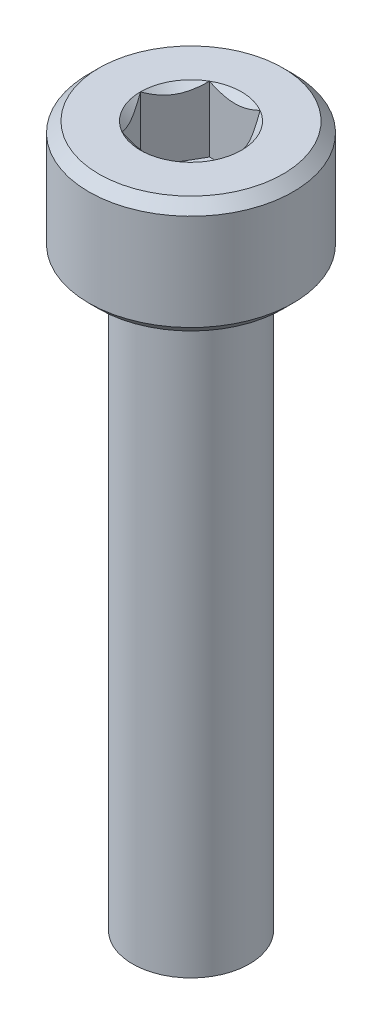
ISO-10303-21;
HEADER;
FILE_DESCRIPTION(('STEP AP214'),'2;1');
FILE_NAME('part.step','',(''),(''),'','','');
FILE_SCHEMA(('AUTOMOTIVE_DESIGN { 1 0 10303 214 1 1 1 1 }'));
ENDSEC;
DATA;
#1=APPLICATION_CONTEXT('core data for automotive mechanical design processes');
#2=APPLICATION_PROTOCOL_DEFINITION('international standard','automotive_design',2000,#1);
#3=PRODUCT_CONTEXT('',#1,'mechanical');
#4=PRODUCT('Part','Part','',(#3));
#5=PRODUCT_RELATED_PRODUCT_CATEGORY('part','',(#4));
#6=PRODUCT_DEFINITION_FORMATION('','',#4);
#7=PRODUCT_DEFINITION_CONTEXT('part definition',#1,'design');
#8=PRODUCT_DEFINITION('design','',#6,#7);
#9=PRODUCT_DEFINITION_SHAPE('','',#8);
#10=(LENGTH_UNIT() NAMED_UNIT(*) SI_UNIT(.MILLI.,.METRE.));
#11=(NAMED_UNIT(*) PLANE_ANGLE_UNIT() SI_UNIT($,.RADIAN.));
#12=(NAMED_UNIT(*) SI_UNIT($,.STERADIAN.) SOLID_ANGLE_UNIT());
#13=UNCERTAINTY_MEASURE_WITH_UNIT(LENGTH_MEASURE(1.E-05),#10,'distance_accuracy_value','');
#14=(GEOMETRIC_REPRESENTATION_CONTEXT(3) GLOBAL_UNCERTAINTY_ASSIGNED_CONTEXT((#13)) GLOBAL_UNIT_ASSIGNED_CONTEXT((#10,
#11,#12)) REPRESENTATION_CONTEXT('',''));
#15=CARTESIAN_POINT('',(0.,0.,0.));
#16=DIRECTION('',(0.,0.,1.));
#17=DIRECTION('',(1.,0.,0.));
#18=AXIS2_PLACEMENT_3D('',#15,#16,#17);
#19=CARTESIAN_POINT('',(0.,4.,0.));
#20=DIRECTION('',(0.,-1.,0.));
#21=DIRECTION('',(0.,0.,-1.));
#22=AXIS2_PLACEMENT_3D('',#19,#20,#21);
#23=CYLINDRICAL_SURFACE('',#22,3.5);
#24=CARTESIAN_POINT('',(0.,0.350000000000001,0.));
#25=DIRECTION('',(0.,1.,0.));
#26=DIRECTION('',(0.,0.,1.));
#27=AXIS2_PLACEMENT_3D('',#24,#25,#26);
#28=CIRCLE('',#27,3.5);
#29=CARTESIAN_POINT('',(0.,0.350000000000001,3.5));
#30=VERTEX_POINT('',#29);
#31=EDGE_CURVE('E227',#30,#30,#28,.T.);
#32=ORIENTED_EDGE('',*,*,#31,.T.);
#33=EDGE_LOOP('',(#32));
#34=FACE_BOUND('',#33,.T.);
#35=CARTESIAN_POINT('',(0.,3.65,0.));
#36=DIRECTION('',(0.,1.,0.));
#37=DIRECTION('',(0.,0.,1.));
#38=AXIS2_PLACEMENT_3D('',#35,#36,#37);
#39=CIRCLE('',#38,3.5);
#40=CARTESIAN_POINT('',(0.,3.65,3.5));
#41=VERTEX_POINT('',#40);
#42=EDGE_CURVE('E104',#41,#41,#39,.F.);
#43=ORIENTED_EDGE('',*,*,#42,.T.);
#44=EDGE_LOOP('',(#43));
#45=FACE_BOUND('',#44,.T.);
#46=ADVANCED_FACE('F32',(#34,#45),#23,.T.);
#47=CARTESIAN_POINT('',(0.,4.,0.));
#48=DIRECTION('',(0.,1.,0.));
#49=DIRECTION('',(0.,0.,1.));
#50=AXIS2_PLACEMENT_3D('',#47,#48,#49);
#51=PLANE('',#50);
#52=CARTESIAN_POINT('',(0.,4.,0.));
#53=DIRECTION('',(0.,1.,0.));
#54=DIRECTION('',(0.,0.,1.));
#55=AXIS2_PLACEMENT_3D('',#52,#53,#54);
#56=CIRCLE('',#55,3.15);
#57=CARTESIAN_POINT('',(0.,4.,3.15));
#58=VERTEX_POINT('',#57);
#59=EDGE_CURVE('E36',#58,#58,#56,.T.);
#60=ORIENTED_EDGE('',*,*,#59,.T.);
#61=EDGE_LOOP('',(#60));
#62=FACE_BOUND('',#61,.T.);
#63=CARTESIAN_POINT('',(0.,4.,0.));
#64=DIRECTION('',(0.,1.,0.));
#65=DIRECTION('',(0.,0.,1.));
#66=AXIS2_PLACEMENT_3D('',#63,#64,#65);
#67=CIRCLE('',#66,1.73205080756888);
#68=CARTESIAN_POINT('',(0.866025403784438,4.,1.5));
#69=VERTEX_POINT('',#68);
#70=CARTESIAN_POINT('',(1.73205080756888,4.,0.));
#71=VERTEX_POINT('',#70);
#72=EDGE_CURVE('E47',#69,#71,#67,.T.);
#73=ORIENTED_EDGE('',*,*,#72,.F.);
#74=CARTESIAN_POINT('',(-0.866025403784438,4.,1.5));
#75=VERTEX_POINT('',#74);
#76=EDGE_CURVE('E54',#75,#69,#67,.T.);
#77=ORIENTED_EDGE('',*,*,#76,.F.);
#78=CARTESIAN_POINT('',(-1.73205080756888,4.,0.));
#79=VERTEX_POINT('',#78);
#80=EDGE_CURVE('E127',#79,#75,#67,.T.);
#81=ORIENTED_EDGE('',*,*,#80,.F.);
#82=CARTESIAN_POINT('',(-0.866025403784439,4.,-1.5));
#83=VERTEX_POINT('',#82);
#84=EDGE_CURVE('E126',#83,#79,#67,.T.);
#85=ORIENTED_EDGE('',*,*,#84,.F.);
#86=CARTESIAN_POINT('',(0.866025403784438,4.,-1.5));
#87=VERTEX_POINT('',#86);
#88=EDGE_CURVE('E94',#87,#83,#67,.T.);
#89=ORIENTED_EDGE('',*,*,#88,.F.);
#90=EDGE_CURVE('E86',#71,#87,#67,.T.);
#91=ORIENTED_EDGE('',*,*,#90,.F.);
#92=EDGE_LOOP('',(#73,#77,#81,#85,#89,#91));
#93=FACE_BOUND('',#92,.T.);
#94=ADVANCED_FACE('F124',(#62,#93),#51,.T.);
#95=CARTESIAN_POINT('',(0.,0.,0.));
#96=DIRECTION('',(0.,1.,0.));
#97=DIRECTION('',(0.,0.,1.));
#98=AXIS2_PLACEMENT_3D('',#95,#96,#97);
#99=PLANE('',#98);
#100=CARTESIAN_POINT('',(0.,0.,0.));
#101=DIRECTION('',(0.,-1.,0.));
#102=DIRECTION('',(0.,0.,-1.));
#103=AXIS2_PLACEMENT_3D('',#100,#101,#102);
#104=CIRCLE('',#103,2.);
#105=CARTESIAN_POINT('',(0.,0.,-2.));
#106=VERTEX_POINT('',#105);
#107=EDGE_CURVE('E11',#106,#106,#104,.T.);
#108=ORIENTED_EDGE('',*,*,#107,.F.);
#109=EDGE_LOOP('',(#108));
#110=FACE_BOUND('',#109,.T.);
#111=CARTESIAN_POINT('',(0.,0.,0.));
#112=DIRECTION('',(0.,1.,0.));
#113=DIRECTION('',(0.,0.,1.));
#114=AXIS2_PLACEMENT_3D('',#111,#112,#113);
#115=CIRCLE('',#114,3.15);
#116=CARTESIAN_POINT('',(0.,0.,3.15));
#117=VERTEX_POINT('',#116);
#118=EDGE_CURVE('E225',#117,#117,#115,.F.);
#119=ORIENTED_EDGE('',*,*,#118,.T.);
#120=EDGE_LOOP('',(#119));
#121=FACE_BOUND('',#120,.T.);
#122=ADVANCED_FACE('F208',(#110,#121),#99,.F.);
#123=CARTESIAN_POINT('',(0.,4.,0.));
#124=DIRECTION('',(0.,1.,0.));
#125=DIRECTION('',(0.,0.,1.));
#126=AXIS2_PLACEMENT_3D('',#123,#124,#125);
#127=CONICAL_SURFACE('',#126,1.73205080756888,0.78539816339745);
#128=ORIENTED_EDGE('',*,*,#88,.T.);
#129=CARTESIAN_POINT('',(-1.72720812969692,4.55557851627079,-1.5));
#130=CARTESIAN_POINT('',(-1.68515175699268,4.52382990785743,-1.5));
#131=CARTESIAN_POINT('',(-1.64286104748673,4.49239259380738,-1.5));
#132=CARTESIAN_POINT('',(-1.55771581035942,4.43026908755641,-1.5));
#133=CARTESIAN_POINT('',(-1.51486114386668,4.3995830858922,-1.5));
#134=CARTESIAN_POINT('',(-1.3846813415127,4.30840719242716,-1.5));
#135=CARTESIAN_POINT('',(-1.29637976071654,4.24928834342677,-1.5));
#136=CARTESIAN_POINT('',(-1.11121478730467,4.1332309963165,-1.5));
#137=CARTESIAN_POINT('',(-1.01415038238167,4.07660955873301,-1.5));
#138=CARTESIAN_POINT('',(-0.815173408897606,3.97303688126565,-1.5));
#139=CARTESIAN_POINT('',(-0.713278669253285,3.92605304154167,-1.5));
#140=CARTESIAN_POINT('',(-0.560333774943112,3.86857266843083,-1.5));
#141=CARTESIAN_POINT('',(-0.511547982948042,3.85207538775725,-1.5));
#142=CARTESIAN_POINT('',(-0.412798620136866,3.822997512927,-1.5));
#143=CARTESIAN_POINT('',(-0.362834968437563,3.81041718859402,-1.5));
#144=CARTESIAN_POINT('',(-0.262863235444982,3.79003619414677,-1.5));
#145=CARTESIAN_POINT('',(-0.212872113808023,3.78215363274598,-1.5));
#146=CARTESIAN_POINT('',(-0.112355243569545,3.771322063969,-1.5));
#147=CARTESIAN_POINT('',(-0.0618295883726279,3.76837220852435,-1.5));
#148=CARTESIAN_POINT('',(0.037429173332384,3.76762485772485,-1.5));
#149=CARTESIAN_POINT('',(0.0861609672002989,3.76964473355808,-1.5));
#150=CARTESIAN_POINT('',(0.183206937768827,3.77832255289676,-1.5));
#151=CARTESIAN_POINT('',(0.231521073438269,3.78498094696846,-1.5));
#152=CARTESIAN_POINT('',(0.328199853425436,3.80268524412257,-1.5));
#153=CARTESIAN_POINT('',(0.376550616310328,3.81380581125704,-1.5));
#154=CARTESIAN_POINT('',(0.472195697125598,3.83984341404871,-1.5));
#155=CARTESIAN_POINT('',(0.51949010309274,3.85476013204094,-1.5));
#156=CARTESIAN_POINT('',(0.668391282696624,3.90733522359607,-1.5));
#157=CARTESIAN_POINT('',(0.767878709508552,3.95098128747198,-1.5));
#158=CARTESIAN_POINT('',(0.962179866690724,4.0480229945931,-1.5));
#159=CARTESIAN_POINT('',(1.05697519961444,4.10145366508953,-1.5));
#160=CARTESIAN_POINT('',(1.23814273533383,4.21168585200456,-1.5));
#161=CARTESIAN_POINT('',(1.3246994218129,4.2681879206986,-1.5));
#162=CARTESIAN_POINT('',(1.45222331290673,4.35553430157866,-1.5));
#163=CARTESIAN_POINT('',(1.49418091978756,4.38495775868004,-1.5));
#164=CARTESIAN_POINT('',(1.57752272931476,4.44458282183046,-1.5));
#165=CARTESIAN_POINT('',(1.61890708647354,4.47478421166444,-1.5));
#166=CARTESIAN_POINT('',(1.66005278019494,4.50530817860946,-1.5));
#167=B_SPLINE_CURVE_WITH_KNOTS('',3,(#129,#130,#131,#132,#133,#134,#135,#136,#137,#138,#139,
#140,#141,#142,#143,#144,#145,#146,#147,#148,#149,#150,#151,#152,#153,#154,#155,#156,#157,#158,
#159,#160,#161,#162,#163,#164,#165,#166),.UNSPECIFIED.,.F.,.F.,(4,2,2,2,2,2,2,2,2,2,2,2,2,2,2,2,
2,2,4),(0.,0.158079548982669,0.316198780993942,0.634850417346958,0.971690311361509,
1.30737131660667,1.46173961127089,1.61611853740677,1.76772101421409,1.91929742368538,
2.065387412096,2.21149159305544,2.36014984633872,2.50879566386709,2.83376031422673,
3.15991186985652,3.46985601802197,3.62358896039974,3.7772796264207),.UNSPECIFIED.);
#168=EDGE_CURVE('E99',#87,#83,#167,.F.);
#169=ORIENTED_EDGE('',*,*,#168,.F.);
#170=EDGE_LOOP('',(#128,#169));
#171=FACE_BOUND('',#170,.T.);
#172=ADVANCED_FACE('F100',(#171),#127,.F.);
#173=ORIENTED_EDGE('',*,*,#84,.T.);
#174=CARTESIAN_POINT('',(-0.865909933730601,4.00011548160007,-1.5002));
#175=CARTESIAN_POINT('',(-0.895682611594166,3.97036547606733,-1.44863220926292));
#176=CARTESIAN_POINT('',(-0.925953159489765,3.94236248391031,-1.3962020823348));
#177=CARTESIAN_POINT('',(-0.987678321317123,3.89108923044014,-1.2892909659444));
#178=CARTESIAN_POINT('',(-1.01913880822717,3.86784750504437,-1.23479980418534));
#179=CARTESIAN_POINT('',(-1.08257741237344,3.82803372899222,-1.12492091864275));
#180=CARTESIAN_POINT('',(-1.11453936608521,3.8113615856709,-1.0695611909048));
#181=CARTESIAN_POINT('',(-1.1791670593912,3.7856744568181,-0.957622742522849));
#182=CARTESIAN_POINT('',(-1.21183082354213,3.77664029047887,-0.901047443446992));
#183=CARTESIAN_POINT('',(-1.26812411040032,3.76848908122685,-0.803544610483559));
#184=CARTESIAN_POINT('',(-1.29168087824208,3.76728225298922,-0.762743091719534));
#185=CARTESIAN_POINT('',(-1.33875285845138,3.76931405716227,-0.681212030384142));
#186=CARTESIAN_POINT('',(-1.36226806050018,3.77255367074831,-0.64048250568537));
#187=CARTESIAN_POINT('',(-1.40907206156905,3.78329198598196,-0.559415597836584));
#188=CARTESIAN_POINT('',(-1.43236062923612,3.79079465301873,-0.519078615401712));
#189=CARTESIAN_POINT('',(-1.47854689118996,3.80965161192829,-0.439081663085969));
#190=CARTESIAN_POINT('',(-1.50144441326545,3.82100755701858,-0.399421991483792));
#191=CARTESIAN_POINT('',(-1.56009461325633,3.85472164759267,-0.297836865225515));
#192=CARTESIAN_POINT('',(-1.59548353987866,3.87962184909337,-0.236541446290311));
#193=CARTESIAN_POINT('',(-1.64751843074894,3.92165665327158,-0.146414371536686));
#194=CARTESIAN_POINT('',(-1.66466545167617,3.9364251535591,-0.116714860092282));
#195=CARTESIAN_POINT('',(-1.69864410935691,3.96731056594017,-0.0578620986162487));
#196=CARTESIAN_POINT('',(-1.71547589206761,3.98342683412171,-0.0287085957793624));
#197=CARTESIAN_POINT('',(-1.73216627762272,4.00011548160007,0.00020000000000028));
#198=B_SPLINE_CURVE_WITH_KNOTS('',3,(#174,#175,#176,#177,#178,#179,#180,#181,#182,#183,#184,
#185,#186,#187,#188,#189,#190,#191,#192,#193,#194,#195,#196,#197),.UNSPECIFIED.,.F.,.F.,(4,2,2,
2,2,2,2,2,2,2,2,4),(0.,0.199829143693304,0.400822987382388,0.598623720538181,0.795926240188889,
0.937113067959881,1.07833105577193,1.21968061668222,1.36109089931054,1.58570969637565,
1.69770705470964,1.80965120737194),.UNSPECIFIED.);
#199=EDGE_CURVE('E129',#83,#79,#198,.T.);
#200=ORIENTED_EDGE('',*,*,#199,.F.);
#201=EDGE_LOOP('',(#173,#200));
#202=FACE_BOUND('',#201,.T.);
#203=ADVANCED_FACE('F240',(#202),#127,.F.);
#204=ORIENTED_EDGE('',*,*,#80,.T.);
#205=CARTESIAN_POINT('',(-1.73216627762272,4.00011548160007,-0.000199999999999694));
#206=CARTESIAN_POINT('',(-1.70239359975915,3.97036547606733,0.051367790737076));
#207=CARTESIAN_POINT('',(-1.67212305186355,3.94236248391031,0.103797917665201));
#208=CARTESIAN_POINT('',(-1.61039789003619,3.89108923044014,0.210709034055597));
#209=CARTESIAN_POINT('',(-1.57893740312614,3.86784750504437,0.265200195814662));
#210=CARTESIAN_POINT('',(-1.51549879897987,3.82803372899222,0.375079081357249));
#211=CARTESIAN_POINT('',(-1.4835368452681,3.8113615856709,0.4304388090952));
#212=CARTESIAN_POINT('',(-1.41890915196211,3.7856744568181,0.542377257477151));
#213=CARTESIAN_POINT('',(-1.38624538781118,3.77664029047887,0.598952556553009));
#214=CARTESIAN_POINT('',(-1.32995210095299,3.76848908122685,0.696455389516441));
#215=CARTESIAN_POINT('',(-1.30639533311124,3.76728225298922,0.737256908280466));
#216=CARTESIAN_POINT('',(-1.25932335290193,3.76931405716227,0.818787969615858));
#217=CARTESIAN_POINT('',(-1.23580815085313,3.77255367074831,0.85951749431463));
#218=CARTESIAN_POINT('',(-1.18900414978427,3.78329198598196,0.940584402163416));
#219=CARTESIAN_POINT('',(-1.1657155821172,3.79079465301873,0.980921384598288));
#220=CARTESIAN_POINT('',(-1.11952932016335,3.80965161192829,1.06091833691403));
#221=CARTESIAN_POINT('',(-1.09663179808786,3.82100755701859,1.10057800851621));
#222=CARTESIAN_POINT('',(-1.03798159809698,3.85472164759267,1.20216313477448));
#223=CARTESIAN_POINT('',(-1.00259267147465,3.87962184909337,1.26345855370969));
#224=CARTESIAN_POINT('',(-0.950557780604375,3.92165665327158,1.35358562846331));
#225=CARTESIAN_POINT('',(-0.933410759677147,3.9364251535591,1.38328513990772));
#226=CARTESIAN_POINT('',(-0.899432101996407,3.96731056594017,1.44213790138375));
#227=CARTESIAN_POINT('',(-0.88260031928571,3.98342683412171,1.47129140422064));
#228=CARTESIAN_POINT('',(-0.865909933730601,4.00011548160007,1.5002));
#229=B_SPLINE_CURVE_WITH_KNOTS('',3,(#205,#206,#207,#208,#209,#210,#211,#212,#213,#214,#215,
#216,#217,#218,#219,#220,#221,#222,#223,#224,#225,#226,#227,#228),.UNSPECIFIED.,.F.,.F.,(4,2,2,
2,2,2,2,2,2,2,2,4),(0.,0.199829143693305,0.400822987382389,0.598623720538181,0.795926240188889,
0.937113067959881,1.07833105577193,1.21968061668222,1.36109089931054,1.58570969637565,
1.69770705470964,1.80965120737194),.UNSPECIFIED.);
#230=EDGE_CURVE('E139',#79,#75,#229,.T.);
#231=ORIENTED_EDGE('',*,*,#230,.F.);
#232=EDGE_LOOP('',(#204,#231));
#233=FACE_BOUND('',#232,.T.);
#234=ADVANCED_FACE('F256',(#233),#127,.F.);
#235=ORIENTED_EDGE('',*,*,#76,.T.);
#236=CARTESIAN_POINT('',(-1.72720812994822,4.55557851646053,1.5));
#237=CARTESIAN_POINT('',(-1.68515175723693,4.52382990803985,1.5));
#238=CARTESIAN_POINT('',(-1.64286104772391,4.49239259398251,1.5));
#239=CARTESIAN_POINT('',(-1.55771581058238,4.43026908771699,1.5));
#240=CARTESIAN_POINT('',(-1.51486114408249,4.39958308604553,1.5));
#241=CARTESIAN_POINT('',(-1.38468134170665,4.30840719255859,1.5));
#242=CARTESIAN_POINT('',(-1.29637976089561,4.24928834354366,1.5));
#243=CARTESIAN_POINT('',(-1.11121478745132,4.13323099640349,1.5));
#244=CARTESIAN_POINT('',(-1.01415038251067,4.07660955880473,1.5));
#245=CARTESIAN_POINT('',(-0.815173408989814,3.9730368813091,1.5));
#246=CARTESIAN_POINT('',(-0.71327866932636,3.92605304157206,1.5));
#247=CARTESIAN_POINT('',(-0.56033377500179,3.86857266845154,1.5));
#248=CARTESIAN_POINT('',(-0.511547983012749,3.85207538777834,1.5));
#249=CARTESIAN_POINT('',(-0.412798620213828,3.82299751294763,1.5));
#250=CARTESIAN_POINT('',(-0.362834968520751,3.8104171886138,1.5));
#251=CARTESIAN_POINT('',(-0.262863235540417,3.79003619416346,1.5));
#252=CARTESIAN_POINT('',(-0.212872113909475,3.78215363276045,1.5));
#253=CARTESIAN_POINT('',(-0.112355243682832,3.77132206397768,1.5));
#254=CARTESIAN_POINT('',(-0.061829588491731,3.76837220852945,1.5));
#255=CARTESIAN_POINT('',(0.0374291732025493,3.76762485772178,1.5));
#256=CARTESIAN_POINT('',(0.086160967065534,3.76964473355048,1.5));
#257=CARTESIAN_POINT('',(0.183206937624695,3.77832255287941,1.5));
#258=CARTESIAN_POINT('',(0.2315210732897,3.78498094694588,1.5));
#259=CARTESIAN_POINT('',(0.328199853268108,3.80268524408904,1.5));
#260=CARTESIAN_POINT('',(0.376550616148692,3.81380581121775,1.5));
#261=CARTESIAN_POINT('',(0.47219569695576,3.83984341399777,1.5));
#262=CARTESIAN_POINT('',(0.51949010291901,3.8547601319841,1.5));
#263=CARTESIAN_POINT('',(0.668391282485064,3.90733522351148,1.5));
#264=CARTESIAN_POINT('',(0.767878709264951,3.95098128736184,1.5));
#265=CARTESIAN_POINT('',(0.9621798663855,4.04802299442906,1.5));
#266=CARTESIAN_POINT('',(1.05697519927965,4.10145366489712,1.5));
#267=CARTESIAN_POINT('',(1.23814273494588,4.21168585175783,1.5));
#268=CARTESIAN_POINT('',(1.32469942140117,4.26818792042618,1.5));
#269=CARTESIAN_POINT('',(1.45222331245985,4.35553430126784,1.5));
#270=CARTESIAN_POINT('',(1.49418091932912,4.38495775835653,1.5));
#271=CARTESIAN_POINT('',(1.5775227288333,4.44458282148157,1.5));
#272=CARTESIAN_POINT('',(1.6189070859806,4.47478421130286,1.5));
#273=CARTESIAN_POINT('',(1.66005277969054,4.50530817823521,1.5));
#274=B_SPLINE_CURVE_WITH_KNOTS('',3,(#236,#237,#238,#239,#240,#241,#242,#243,#244,#245,#246,
#247,#248,#249,#250,#251,#252,#253,#254,#255,#256,#257,#258,#259,#260,#261,#262,#263,#264,#265,
#266,#267,#268,#269,#270,#271,#272,#273),.UNSPECIFIED.,.F.,.F.,(4,2,2,2,2,2,2,2,2,2,2,2,2,2,2,2,
2,2,4),(0.,0.158079549012757,0.316198781054129,0.634850417468465,0.971690311551782,
1.30737131686505,1.46173961151184,1.61611853763032,1.76772101442095,1.91929742387554,
2.06538741227089,2.21149159321503,2.36014984648185,2.50879566399376,2.83376031423511,
3.15991186974582,3.4698560178094,3.62358896013692,3.77727962610764),.UNSPECIFIED.);
#275=EDGE_CURVE('E168',#75,#69,#274,.T.);
#276=ORIENTED_EDGE('',*,*,#275,.F.);
#277=EDGE_LOOP('',(#235,#276));
#278=FACE_BOUND('',#277,.T.);
#279=ADVANCED_FACE('F286',(#278),#127,.F.);
#280=ORIENTED_EDGE('',*,*,#72,.T.);
#281=CARTESIAN_POINT('',(0.865909933730601,4.00011548160007,1.5002));
#282=CARTESIAN_POINT('',(0.895682611594166,3.97036547606733,1.44863220926292));
#283=CARTESIAN_POINT('',(0.925953159489765,3.94236248391031,1.3962020823348));
#284=CARTESIAN_POINT('',(0.987678321317124,3.89108923044014,1.2892909659444));
#285=CARTESIAN_POINT('',(1.01913880822717,3.86784750504437,1.23479980418534));
#286=CARTESIAN_POINT('',(1.08257741237344,3.82803372899222,1.12492091864275));
#287=CARTESIAN_POINT('',(1.11453936608521,3.8113615856709,1.0695611909048));
#288=CARTESIAN_POINT('',(1.1791670593912,3.7856744568181,0.95762274252285));
#289=CARTESIAN_POINT('',(1.21183082354213,3.77664029047887,0.901047443446992));
#290=CARTESIAN_POINT('',(1.26812411040032,3.76848908122685,0.80354461048356));
#291=CARTESIAN_POINT('',(1.29168087824208,3.76728225298922,0.762743091719534));
#292=CARTESIAN_POINT('',(1.33875285845138,3.76931405716227,0.681212030384142));
#293=CARTESIAN_POINT('',(1.36226806050018,3.77255367074831,0.640482505685371));
#294=CARTESIAN_POINT('',(1.40907206156905,3.78329198598196,0.559415597836584));
#295=CARTESIAN_POINT('',(1.43236062923612,3.79079465301873,0.519078615401712));
#296=CARTESIAN_POINT('',(1.47854689118996,3.80965161192829,0.43908166308597));
#297=CARTESIAN_POINT('',(1.50144441326545,3.82100755701859,0.399421991483792));
#298=CARTESIAN_POINT('',(1.56009461325633,3.85472164759267,0.297836865225515));
#299=CARTESIAN_POINT('',(1.59548353987866,3.87962184909337,0.236541446290311));
#300=CARTESIAN_POINT('',(1.64751843074894,3.92165665327158,0.146414371536686));
#301=CARTESIAN_POINT('',(1.66466545167617,3.9364251535591,0.116714860092282));
#302=CARTESIAN_POINT('',(1.69864410935691,3.96731056594017,0.0578620986162488));
#303=CARTESIAN_POINT('',(1.71547589206761,3.98342683412171,0.0287085957793626));
#304=CARTESIAN_POINT('',(1.73216627762272,4.00011548160007,-0.000200000000000026));
#305=B_SPLINE_CURVE_WITH_KNOTS('',3,(#281,#282,#283,#284,#285,#286,#287,#288,#289,#290,#291,
#292,#293,#294,#295,#296,#297,#298,#299,#300,#301,#302,#303,#304),.UNSPECIFIED.,.F.,.F.,(4,2,2,
2,2,2,2,2,2,2,2,4),(0.,0.199829143693305,0.400822987382389,0.59862372053818,0.795926240188889,
0.937113067959881,1.07833105577193,1.21968061668222,1.36109089931054,1.58570969637565,
1.69770705470964,1.80965120737194),.UNSPECIFIED.);
#306=EDGE_CURVE('E114',#69,#71,#305,.T.);
#307=ORIENTED_EDGE('',*,*,#306,.F.);
#308=EDGE_LOOP('',(#280,#307));
#309=FACE_BOUND('',#308,.T.);
#310=ADVANCED_FACE('F154',(#309),#127,.F.);
#311=ORIENTED_EDGE('',*,*,#90,.T.);
#312=CARTESIAN_POINT('',(1.73216627762272,4.00011548160007,0.000200000000000282));
#313=CARTESIAN_POINT('',(1.70239359975915,3.97036547606733,-0.0513677907370753));
#314=CARTESIAN_POINT('',(1.67212305186355,3.94236248391031,-0.103797917665201));
#315=CARTESIAN_POINT('',(1.61039789003619,3.89108923044014,-0.210709034055596));
#316=CARTESIAN_POINT('',(1.57893740312614,3.86784750504437,-0.265200195814661));
#317=CARTESIAN_POINT('',(1.51549879897987,3.82803372899222,-0.375079081357248));
#318=CARTESIAN_POINT('',(1.4835368452681,3.8113615856709,-0.430438809095199));
#319=CARTESIAN_POINT('',(1.41890915196211,3.7856744568181,-0.54237725747715));
#320=CARTESIAN_POINT('',(1.38624538781118,3.77664029047887,-0.598952556553008));
#321=CARTESIAN_POINT('',(1.32995210095299,3.76848908122685,-0.69645538951644));
#322=CARTESIAN_POINT('',(1.30639533311124,3.76728225298922,-0.737256908280466));
#323=CARTESIAN_POINT('',(1.25932335290193,3.76931405716227,-0.818787969615858));
#324=CARTESIAN_POINT('',(1.23580815085313,3.77255367074831,-0.85951749431463));
#325=CARTESIAN_POINT('',(1.18900414978427,3.78329198598196,-0.940584402163416));
#326=CARTESIAN_POINT('',(1.1657155821172,3.79079465301873,-0.980921384598288));
#327=CARTESIAN_POINT('',(1.11952932016335,3.80965161192829,-1.06091833691403));
#328=CARTESIAN_POINT('',(1.09663179808786,3.82100755701858,-1.10057800851621));
#329=CARTESIAN_POINT('',(1.03798159809698,3.85472164759267,-1.20216313477448));
#330=CARTESIAN_POINT('',(1.00259267147465,3.87962184909337,-1.26345855370969));
#331=CARTESIAN_POINT('',(0.950557780604375,3.92165665327158,-1.35358562846331));
#332=CARTESIAN_POINT('',(0.933410759677148,3.9364251535591,-1.38328513990772));
#333=CARTESIAN_POINT('',(0.899432101996407,3.96731056594017,-1.44213790138375));
#334=CARTESIAN_POINT('',(0.88260031928571,3.98342683412171,-1.47129140422064));
#335=CARTESIAN_POINT('',(0.865909933730601,4.00011548160007,-1.5002));
#336=B_SPLINE_CURVE_WITH_KNOTS('',3,(#312,#313,#314,#315,#316,#317,#318,#319,#320,#321,#322,
#323,#324,#325,#326,#327,#328,#329,#330,#331,#332,#333,#334,#335),.UNSPECIFIED.,.F.,.F.,(4,2,2,
2,2,2,2,2,2,2,2,4),(0.,0.199829143693305,0.400822987382389,0.598623720538181,0.79592624018889,
0.937113067959881,1.07833105577193,1.21968061668222,1.36109089931054,1.58570969637566,
1.69770705470964,1.80965120737194),.UNSPECIFIED.);
#337=EDGE_CURVE('E90',#71,#87,#336,.T.);
#338=ORIENTED_EDGE('',*,*,#337,.F.);
#339=EDGE_LOOP('',(#311,#338));
#340=FACE_BOUND('',#339,.T.);
#341=ADVANCED_FACE('F88',(#340),#127,.F.);
#342=CARTESIAN_POINT('',(0.,1.75,0.));
#343=DIRECTION('',(0.,1.,0.));
#344=DIRECTION('',(0.,0.,1.));
#345=AXIS2_PLACEMENT_3D('',#342,#343,#344);
#346=PLANE('',#345);
#347=DIRECTION('',(-0.5,0.,-0.866025403784439));
#348=VECTOR('',#347,1.);
#349=CARTESIAN_POINT('',(1.73205080756888,1.75,0.));
#350=LINE('',#349,#348);
#351=CARTESIAN_POINT('',(1.73205080756888,1.75,0.));
#352=VERTEX_POINT('',#351);
#353=CARTESIAN_POINT('',(0.866025403784438,1.75,-1.5));
#354=VERTEX_POINT('',#353);
#355=EDGE_CURVE('E113',#352,#354,#350,.T.);
#356=ORIENTED_EDGE('',*,*,#355,.T.);
#357=DIRECTION('',(-1.,0.,0.));
#358=VECTOR('',#357,1.);
#359=CARTESIAN_POINT('',(0.866025403784438,1.75,-1.5));
#360=LINE('',#359,#358);
#361=CARTESIAN_POINT('',(-0.866025403784439,1.75,-1.5));
#362=VERTEX_POINT('',#361);
#363=EDGE_CURVE('E118',#354,#362,#360,.T.);
#364=ORIENTED_EDGE('',*,*,#363,.T.);
#365=DIRECTION('',(-0.5,0.,0.866025403784439));
#366=VECTOR('',#365,1.);
#367=CARTESIAN_POINT('',(-0.866025403784439,1.75,-1.5));
#368=LINE('',#367,#366);
#369=CARTESIAN_POINT('',(-1.73205080756888,1.75,0.));
#370=VERTEX_POINT('',#369);
#371=EDGE_CURVE('E280',#362,#370,#368,.T.);
#372=ORIENTED_EDGE('',*,*,#371,.T.);
#373=DIRECTION('',(0.5,0.,0.866025403784439));
#374=VECTOR('',#373,1.);
#375=CARTESIAN_POINT('',(-1.73205080756888,1.75,0.));
#376=LINE('',#375,#374);
#377=CARTESIAN_POINT('',(-0.866025403784438,1.75,1.5));
#378=VERTEX_POINT('',#377);
#379=EDGE_CURVE('E263',#370,#378,#376,.T.);
#380=ORIENTED_EDGE('',*,*,#379,.T.);
#381=DIRECTION('',(1.,0.,0.));
#382=VECTOR('',#381,1.);
#383=CARTESIAN_POINT('',(-0.866025403784438,1.75,1.5));
#384=LINE('',#383,#382);
#385=CARTESIAN_POINT('',(0.866025403784439,1.75,1.5));
#386=VERTEX_POINT('',#385);
#387=EDGE_CURVE('E276',#378,#386,#384,.T.);
#388=ORIENTED_EDGE('',*,*,#387,.T.);
#389=DIRECTION('',(0.5,0.,-0.866025403784439));
#390=VECTOR('',#389,1.);
#391=CARTESIAN_POINT('',(0.866025403784439,1.75,1.5));
#392=LINE('',#391,#390);
#393=EDGE_CURVE('E121',#386,#352,#392,.T.);
#394=ORIENTED_EDGE('',*,*,#393,.T.);
#395=EDGE_LOOP('',(#356,#364,#372,#380,#388,#394));
#396=FACE_BOUND('',#395,.T.);
#397=ADVANCED_FACE('F153',(#396),#346,.T.);
#398=CARTESIAN_POINT('',(0.866025403784438,1.75,-1.5));
#399=DIRECTION('',(0.,0.,-1.));
#400=DIRECTION('',(-1.,0.,0.));
#401=AXIS2_PLACEMENT_3D('',#398,#399,#400);
#402=PLANE('',#401);
#403=DIRECTION('',(0.,1.,0.));
#404=VECTOR('',#403,1.);
#405=CARTESIAN_POINT('',(0.866025403784438,1.75,-1.5));
#406=LINE('',#405,#404);
#407=EDGE_CURVE('E111',#354,#87,#406,.T.);
#408=ORIENTED_EDGE('',*,*,#407,.T.);
#409=ORIENTED_EDGE('',*,*,#168,.T.);
#410=DIRECTION('',(0.,1.,0.));
#411=VECTOR('',#410,1.);
#412=CARTESIAN_POINT('',(-0.866025403784439,1.75,-1.5));
#413=LINE('',#412,#411);
#414=EDGE_CURVE('E120',#362,#83,#413,.T.);
#415=ORIENTED_EDGE('',*,*,#414,.F.);
#416=ORIENTED_EDGE('',*,*,#363,.F.);
#417=EDGE_LOOP('',(#408,#409,#415,#416));
#418=FACE_BOUND('',#417,.T.);
#419=ADVANCED_FACE('F116',(#418),#402,.F.);
#420=CARTESIAN_POINT('',(-0.866025403784439,1.75,-1.5));
#421=DIRECTION('',(-0.866025403784439,0.,-0.5));
#422=DIRECTION('',(-0.5,0.,0.866025403784439));
#423=AXIS2_PLACEMENT_3D('',#420,#421,#422);
#424=PLANE('',#423);
#425=ORIENTED_EDGE('',*,*,#414,.T.);
#426=ORIENTED_EDGE('',*,*,#199,.T.);
#427=DIRECTION('',(0.,1.,0.));
#428=VECTOR('',#427,1.);
#429=CARTESIAN_POINT('',(-1.73205080756888,1.75,0.));
#430=LINE('',#429,#428);
#431=EDGE_CURVE('E259',#370,#79,#430,.T.);
#432=ORIENTED_EDGE('',*,*,#431,.F.);
#433=ORIENTED_EDGE('',*,*,#371,.F.);
#434=EDGE_LOOP('',(#425,#426,#432,#433));
#435=FACE_BOUND('',#434,.T.);
#436=ADVANCED_FACE('F146',(#435),#424,.F.);
#437=CARTESIAN_POINT('',(-1.73205080756888,1.75,0.));
#438=DIRECTION('',(-0.866025403784439,0.,0.5));
#439=DIRECTION('',(0.5,0.,0.866025403784439));
#440=AXIS2_PLACEMENT_3D('',#437,#438,#439);
#441=PLANE('',#440);
#442=ORIENTED_EDGE('',*,*,#431,.T.);
#443=ORIENTED_EDGE('',*,*,#230,.T.);
#444=DIRECTION('',(0.,1.,0.));
#445=VECTOR('',#444,1.);
#446=CARTESIAN_POINT('',(-0.866025403784438,1.75,1.5));
#447=LINE('',#446,#445);
#448=EDGE_CURVE('E265',#378,#75,#447,.T.);
#449=ORIENTED_EDGE('',*,*,#448,.F.);
#450=ORIENTED_EDGE('',*,*,#379,.F.);
#451=EDGE_LOOP('',(#442,#443,#449,#450));
#452=FACE_BOUND('',#451,.T.);
#453=ADVANCED_FACE('F192',(#452),#441,.F.);
#454=CARTESIAN_POINT('',(-0.866025403784438,1.75,1.5));
#455=DIRECTION('',(0.,0.,1.));
#456=DIRECTION('',(1.,0.,0.));
#457=AXIS2_PLACEMENT_3D('',#454,#455,#456);
#458=PLANE('',#457);
#459=ORIENTED_EDGE('',*,*,#448,.T.);
#460=ORIENTED_EDGE('',*,*,#275,.T.);
#461=DIRECTION('',(0.,1.,0.));
#462=VECTOR('',#461,1.);
#463=CARTESIAN_POINT('',(0.866025403784439,1.75,1.5));
#464=LINE('',#463,#462);
#465=EDGE_CURVE('E267',#386,#69,#464,.T.);
#466=ORIENTED_EDGE('',*,*,#465,.F.);
#467=ORIENTED_EDGE('',*,*,#387,.F.);
#468=EDGE_LOOP('',(#459,#460,#466,#467));
#469=FACE_BOUND('',#468,.T.);
#470=ADVANCED_FACE('F188',(#469),#458,.F.);
#471=CARTESIAN_POINT('',(0.866025403784439,1.75,1.5));
#472=DIRECTION('',(0.866025403784439,0.,0.5));
#473=DIRECTION('',(0.5,0.,-0.866025403784439));
#474=AXIS2_PLACEMENT_3D('',#471,#472,#473);
#475=PLANE('',#474);
#476=ORIENTED_EDGE('',*,*,#465,.T.);
#477=ORIENTED_EDGE('',*,*,#306,.T.);
#478=DIRECTION('',(0.,1.,0.));
#479=VECTOR('',#478,1.);
#480=CARTESIAN_POINT('',(1.73205080756888,1.75,0.));
#481=LINE('',#480,#479);
#482=EDGE_CURVE('E105',#352,#71,#481,.T.);
#483=ORIENTED_EDGE('',*,*,#482,.F.);
#484=ORIENTED_EDGE('',*,*,#393,.F.);
#485=EDGE_LOOP('',(#476,#477,#483,#484));
#486=FACE_BOUND('',#485,.T.);
#487=ADVANCED_FACE('F185',(#486),#475,.F.);
#488=CARTESIAN_POINT('',(1.73205080756888,1.75,0.));
#489=DIRECTION('',(0.866025403784439,0.,-0.5));
#490=DIRECTION('',(-0.5,0.,-0.866025403784439));
#491=AXIS2_PLACEMENT_3D('',#488,#489,#490);
#492=PLANE('',#491);
#493=ORIENTED_EDGE('',*,*,#482,.T.);
#494=ORIENTED_EDGE('',*,*,#337,.T.);
#495=ORIENTED_EDGE('',*,*,#407,.F.);
#496=ORIENTED_EDGE('',*,*,#355,.F.);
#497=EDGE_LOOP('',(#493,#494,#495,#496));
#498=FACE_BOUND('',#497,.T.);
#499=ADVANCED_FACE('F109',(#498),#492,.F.);
#500=CARTESIAN_POINT('',(0.,0.350000000000001,0.));
#501=DIRECTION('',(0.,1.,0.));
#502=DIRECTION('',(0.,0.,1.));
#503=AXIS2_PLACEMENT_3D('',#500,#501,#502);
#504=CONICAL_SURFACE('',#503,3.5,0.78539816339745);
#505=ORIENTED_EDGE('',*,*,#118,.F.);
#506=EDGE_LOOP('',(#505));
#507=FACE_BOUND('',#506,.T.);
#508=ORIENTED_EDGE('',*,*,#31,.F.);
#509=EDGE_LOOP('',(#508));
#510=FACE_BOUND('',#509,.T.);
#511=ADVANCED_FACE('F214',(#507,#510),#504,.T.);
#512=CARTESIAN_POINT('',(0.,4.,0.));
#513=DIRECTION('',(0.,-1.,0.));
#514=DIRECTION('',(0.,0.,-1.));
#515=AXIS2_PLACEMENT_3D('',#512,#513,#514);
#516=CONICAL_SURFACE('',#515,3.15,0.785398163397448);
#517=ORIENTED_EDGE('',*,*,#42,.F.);
#518=EDGE_LOOP('',(#517));
#519=FACE_BOUND('',#518,.T.);
#520=ORIENTED_EDGE('',*,*,#59,.F.);
#521=EDGE_LOOP('',(#520));
#522=FACE_BOUND('',#521,.T.);
#523=ADVANCED_FACE('F34',(#519,#522),#516,.T.);
#524=CARTESIAN_POINT('',(0.,-20.,0.));
#525=DIRECTION('',(0.,1.,0.));
#526=DIRECTION('',(0.,0.,1.));
#527=AXIS2_PLACEMENT_3D('',#524,#525,#526);
#528=CYLINDRICAL_SURFACE('',#527,2.);
#529=CARTESIAN_POINT('',(0.,-20.,0.));
#530=DIRECTION('',(0.,-1.,0.));
#531=DIRECTION('',(0.,0.,-1.));
#532=AXIS2_PLACEMENT_3D('',#529,#530,#531);
#533=CIRCLE('',#532,2.);
#534=CARTESIAN_POINT('',(0.,-20.,-2.));
#535=VERTEX_POINT('',#534);
#536=EDGE_CURVE('E252',#535,#535,#533,.T.);
#537=ORIENTED_EDGE('',*,*,#536,.F.);
#538=EDGE_LOOP('',(#537));
#539=FACE_BOUND('',#538,.T.);
#540=ORIENTED_EDGE('',*,*,#107,.T.);
#541=EDGE_LOOP('',(#540));
#542=FACE_BOUND('',#541,.T.);
#543=ADVANCED_FACE('F155',(#539,#542),#528,.T.);
#544=CARTESIAN_POINT('',(0.,-20.,0.));
#545=DIRECTION('',(0.,-1.,0.));
#546=DIRECTION('',(0.,0.,-1.));
#547=AXIS2_PLACEMENT_3D('',#544,#545,#546);
#548=PLANE('',#547);
#549=ORIENTED_EDGE('',*,*,#536,.T.);
#550=EDGE_LOOP('',(#549));
#551=FACE_BOUND('',#550,.T.);
#552=ADVANCED_FACE('F244',(#551),#548,.T.);
#553=CLOSED_SHELL('',(#46,#94,#122,#172,#203,#234,#279,#310,#341,#397,#419,#436,#453,#470,#487,
#499,#511,#523,#543,#552));
#554=MANIFOLD_SOLID_BREP('B2',#553);
#555=ADVANCED_BREP_SHAPE_REPRESENTATION('',(#18,#554),#14);
#556=SHAPE_DEFINITION_REPRESENTATION(#9,#555);
ENDSEC;
END-ISO-10303-21;
